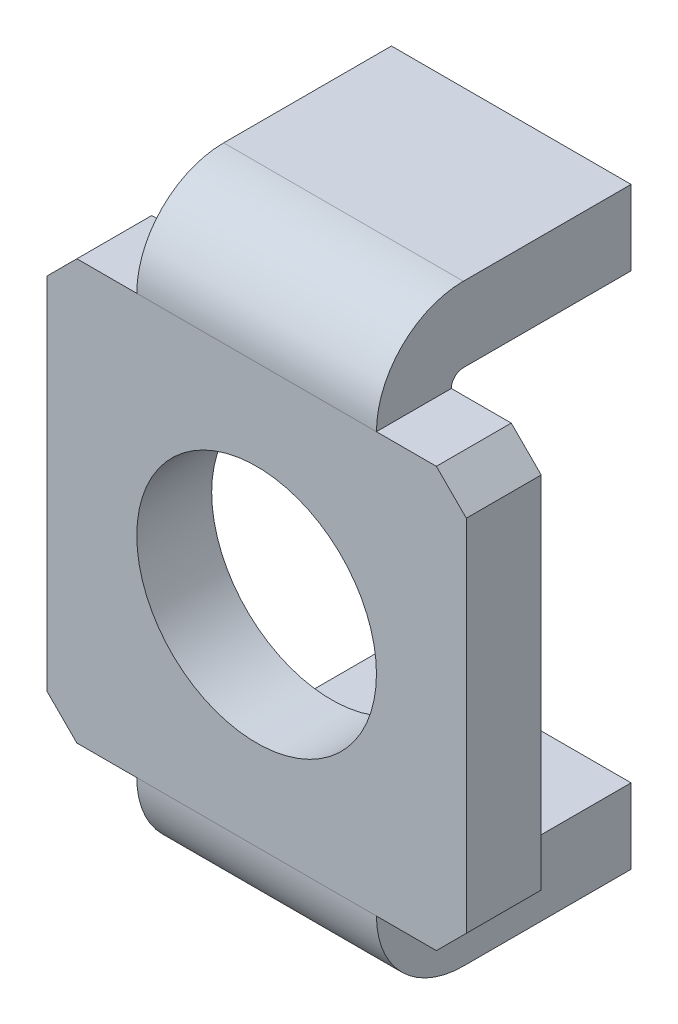
ISO-10303-21;
HEADER;
FILE_DESCRIPTION(('STEP AP214'),'2;1');
FILE_NAME('part.step','',(''),(''),'','','');
FILE_SCHEMA(('AUTOMOTIVE_DESIGN { 1 0 10303 214 1 1 1 1 }'));
ENDSEC;
DATA;
#1=APPLICATION_CONTEXT('core data for automotive mechanical design processes');
#2=APPLICATION_PROTOCOL_DEFINITION('international standard','automotive_design',2000,#1);
#3=PRODUCT_CONTEXT('',#1,'mechanical');
#4=PRODUCT('Part','Part','',(#3));
#5=PRODUCT_RELATED_PRODUCT_CATEGORY('part','',(#4));
#6=PRODUCT_DEFINITION_FORMATION('','',#4);
#7=PRODUCT_DEFINITION_CONTEXT('part definition',#1,'design');
#8=PRODUCT_DEFINITION('design','',#6,#7);
#9=PRODUCT_DEFINITION_SHAPE('','',#8);
#10=(LENGTH_UNIT() NAMED_UNIT(*) SI_UNIT(.MILLI.,.METRE.));
#11=(NAMED_UNIT(*) PLANE_ANGLE_UNIT() SI_UNIT($,.RADIAN.));
#12=(NAMED_UNIT(*) SI_UNIT($,.STERADIAN.) SOLID_ANGLE_UNIT());
#13=UNCERTAINTY_MEASURE_WITH_UNIT(LENGTH_MEASURE(1.E-05),#10,'distance_accuracy_value','');
#14=(GEOMETRIC_REPRESENTATION_CONTEXT(3) GLOBAL_UNCERTAINTY_ASSIGNED_CONTEXT((#13)) GLOBAL_UNIT_ASSIGNED_CONTEXT((#10,
#11,#12)) REPRESENTATION_CONTEXT('',''));
#15=CARTESIAN_POINT('',(0.,0.,0.));
#16=DIRECTION('',(0.,0.,1.));
#17=DIRECTION('',(1.,0.,0.));
#18=AXIS2_PLACEMENT_3D('',#15,#16,#17);
#19=CARTESIAN_POINT('',(0.,-4.95,0.));
#20=DIRECTION('',(0.,1.,0.));
#21=DIRECTION('',(0.,0.,1.));
#22=AXIS2_PLACEMENT_3D('',#19,#20,#21);
#23=PLANE('',#22);
#24=DIRECTION('',(0.,0.,1.));
#25=VECTOR('',#24,1.);
#26=CARTESIAN_POINT('',(-2.,-4.95,-4.25));
#27=LINE('',#26,#25);
#28=CARTESIAN_POINT('',(-2.,-4.95,-4.25));
#29=VERTEX_POINT('',#28);
#30=CARTESIAN_POINT('',(-2.,-4.95,-1.45));
#31=VERTEX_POINT('',#30);
#32=EDGE_CURVE('E189',#29,#31,#27,.T.);
#33=ORIENTED_EDGE('',*,*,#32,.F.);
#34=DIRECTION('',(1.,0.,0.));
#35=VECTOR('',#34,1.);
#36=CARTESIAN_POINT('',(-2.,-4.95,-4.25));
#37=LINE('',#36,#35);
#38=CARTESIAN_POINT('',(2.,-4.95,-4.25));
#39=VERTEX_POINT('',#38);
#40=EDGE_CURVE('E199',#39,#29,#37,.F.);
#41=ORIENTED_EDGE('',*,*,#40,.F.);
#42=DIRECTION('',(0.,0.,-1.));
#43=VECTOR('',#42,1.);
#44=CARTESIAN_POINT('',(2.,-4.95,-4.25));
#45=LINE('',#44,#43);
#46=CARTESIAN_POINT('',(2.,-4.95,-1.45));
#47=VERTEX_POINT('',#46);
#48=EDGE_CURVE('E192',#47,#39,#45,.T.);
#49=ORIENTED_EDGE('',*,*,#48,.F.);
#50=DIRECTION('',(-1.,0.,0.));
#51=VECTOR('',#50,1.);
#52=CARTESIAN_POINT('',(-2.,-4.95,-1.45));
#53=LINE('',#52,#51);
#54=EDGE_CURVE('E253',#31,#47,#53,.F.);
#55=ORIENTED_EDGE('',*,*,#54,.F.);
#56=EDGE_LOOP('',(#33,#41,#49,#55));
#57=FACE_BOUND('',#56,.T.);
#58=ADVANCED_FACE('F17',(#57),#23,.F.);
#59=CARTESIAN_POINT('',(0.,4.95,0.));
#60=DIRECTION('',(0.,-1.,0.));
#61=DIRECTION('',(0.,0.,-1.));
#62=AXIS2_PLACEMENT_3D('',#59,#60,#61);
#63=PLANE('',#62);
#64=DIRECTION('',(0.,0.,1.));
#65=VECTOR('',#64,1.);
#66=CARTESIAN_POINT('',(2.,4.95,-4.25));
#67=LINE('',#66,#65);
#68=CARTESIAN_POINT('',(2.,4.95,-1.45));
#69=VERTEX_POINT('',#68);
#70=CARTESIAN_POINT('',(2.,4.95,-4.25));
#71=VERTEX_POINT('',#70);
#72=EDGE_CURVE('E245',#69,#71,#67,.F.);
#73=ORIENTED_EDGE('',*,*,#72,.T.);
#74=DIRECTION('',(1.,0.,0.));
#75=VECTOR('',#74,1.);
#76=CARTESIAN_POINT('',(-2.,4.95,-4.25));
#77=LINE('',#76,#75);
#78=CARTESIAN_POINT('',(-2.,4.95,-4.25));
#79=VERTEX_POINT('',#78);
#80=EDGE_CURVE('E332',#71,#79,#77,.F.);
#81=ORIENTED_EDGE('',*,*,#80,.T.);
#82=DIRECTION('',(0.,0.,-1.));
#83=VECTOR('',#82,1.);
#84=CARTESIAN_POINT('',(-2.,4.95,-4.25));
#85=LINE('',#84,#83);
#86=CARTESIAN_POINT('',(-2.,4.95,-1.45));
#87=VERTEX_POINT('',#86);
#88=EDGE_CURVE('E337',#79,#87,#85,.F.);
#89=ORIENTED_EDGE('',*,*,#88,.T.);
#90=DIRECTION('',(1.,0.,0.));
#91=VECTOR('',#90,1.);
#92=CARTESIAN_POINT('',(2.,4.95,-1.45));
#93=LINE('',#92,#91);
#94=EDGE_CURVE('E246',#69,#87,#93,.F.);
#95=ORIENTED_EDGE('',*,*,#94,.F.);
#96=EDGE_LOOP('',(#73,#81,#89,#95));
#97=FACE_BOUND('',#96,.T.);
#98=ADVANCED_FACE('F349',(#97),#63,.F.);
#99=CARTESIAN_POINT('',(-2.,-4.95,-4.25));
#100=DIRECTION('',(-1.,0.,0.));
#101=DIRECTION('',(0.,0.,1.));
#102=AXIS2_PLACEMENT_3D('',#99,#100,#101);
#103=PLANE('',#102);
#104=DIRECTION('',(0.,0.,1.));
#105=VECTOR('',#104,1.);
#106=CARTESIAN_POINT('',(-2.,-3.7,0.));
#107=LINE('',#106,#105);
#108=CARTESIAN_POINT('',(-2.,-3.7,-4.25));
#109=VERTEX_POINT('',#108);
#110=CARTESIAN_POINT('',(-2.,-3.7,-1.45));
#111=VERTEX_POINT('',#110);
#112=EDGE_CURVE('E154',#109,#111,#107,.T.);
#113=ORIENTED_EDGE('',*,*,#112,.F.);
#114=DIRECTION('',(0.,1.,0.));
#115=VECTOR('',#114,1.);
#116=CARTESIAN_POINT('',(-2.,-4.95,-4.25));
#117=LINE('',#116,#115);
#118=EDGE_CURVE('E196',#29,#109,#117,.T.);
#119=ORIENTED_EDGE('',*,*,#118,.F.);
#120=ORIENTED_EDGE('',*,*,#32,.T.);
#121=CARTESIAN_POINT('',(-2.,-3.5,-1.45));
#122=DIRECTION('',(-1.,0.,0.));
#123=DIRECTION('',(0.,0.,1.));
#124=AXIS2_PLACEMENT_3D('',#121,#122,#123);
#125=CIRCLE('',#124,1.45);
#126=CARTESIAN_POINT('',(-2.,-3.5,0.));
#127=VERTEX_POINT('',#126);
#128=EDGE_CURVE('E198',#127,#31,#125,.F.);
#129=ORIENTED_EDGE('',*,*,#128,.F.);
#130=DIRECTION('',(0.,0.,-1.));
#131=VECTOR('',#130,1.);
#132=CARTESIAN_POINT('',(-2.,-3.5,-1.45));
#133=LINE('',#132,#131);
#134=CARTESIAN_POINT('',(-2.,-3.5,-1.25));
#135=VERTEX_POINT('',#134);
#136=EDGE_CURVE('E157',#135,#127,#133,.F.);
#137=ORIENTED_EDGE('',*,*,#136,.F.);
#138=CARTESIAN_POINT('',(-2.,-3.5,-1.45));
#139=DIRECTION('',(-1.,0.,0.));
#140=DIRECTION('',(0.,0.,1.));
#141=AXIS2_PLACEMENT_3D('',#138,#139,#140);
#142=CIRCLE('',#141,0.2);
#143=EDGE_CURVE('E20',#111,#135,#142,.T.);
#144=ORIENTED_EDGE('',*,*,#143,.F.);
#145=EDGE_LOOP('',(#113,#119,#120,#129,#137,#144));
#146=FACE_BOUND('',#145,.T.);
#147=ADVANCED_FACE('F152',(#146),#103,.T.);
#148=CARTESIAN_POINT('',(2.,-4.95,-4.25));
#149=DIRECTION('',(1.,0.,0.));
#150=DIRECTION('',(0.,0.,-1.));
#151=AXIS2_PLACEMENT_3D('',#148,#149,#150);
#152=PLANE('',#151);
#153=ORIENTED_EDGE('',*,*,#48,.T.);
#154=DIRECTION('',(0.,1.,0.));
#155=VECTOR('',#154,1.);
#156=CARTESIAN_POINT('',(2.,-4.95,-4.25));
#157=LINE('',#156,#155);
#158=CARTESIAN_POINT('',(2.,-3.7,-4.25));
#159=VERTEX_POINT('',#158);
#160=EDGE_CURVE('E276',#159,#39,#157,.F.);
#161=ORIENTED_EDGE('',*,*,#160,.F.);
#162=DIRECTION('',(0.,0.,1.));
#163=VECTOR('',#162,1.);
#164=CARTESIAN_POINT('',(2.,-3.7,0.));
#165=LINE('',#164,#163);
#166=CARTESIAN_POINT('',(2.,-3.7,-1.45));
#167=VERTEX_POINT('',#166);
#168=EDGE_CURVE('E171',#167,#159,#165,.F.);
#169=ORIENTED_EDGE('',*,*,#168,.F.);
#170=CARTESIAN_POINT('',(2.,-3.5,-1.45));
#171=DIRECTION('',(-1.,0.,0.));
#172=DIRECTION('',(0.,0.,1.));
#173=AXIS2_PLACEMENT_3D('',#170,#171,#172);
#174=CIRCLE('',#173,0.2);
#175=CARTESIAN_POINT('',(2.,-3.5,-1.25));
#176=VERTEX_POINT('',#175);
#177=EDGE_CURVE('E162',#167,#176,#174,.T.);
#178=ORIENTED_EDGE('',*,*,#177,.T.);
#179=DIRECTION('',(0.,0.,-1.));
#180=VECTOR('',#179,1.);
#181=CARTESIAN_POINT('',(2.,-3.5,-1.45));
#182=LINE('',#181,#180);
#183=CARTESIAN_POINT('',(2.,-3.5,0.));
#184=VERTEX_POINT('',#183);
#185=EDGE_CURVE('E260',#176,#184,#182,.F.);
#186=ORIENTED_EDGE('',*,*,#185,.T.);
#187=CARTESIAN_POINT('',(2.,-3.5,-1.45));
#188=DIRECTION('',(-1.,0.,0.));
#189=DIRECTION('',(0.,0.,1.));
#190=AXIS2_PLACEMENT_3D('',#187,#188,#189);
#191=CIRCLE('',#190,1.45);
#192=EDGE_CURVE('E250',#47,#184,#191,.T.);
#193=ORIENTED_EDGE('',*,*,#192,.F.);
#194=EDGE_LOOP('',(#153,#161,#169,#178,#186,#193));
#195=FACE_BOUND('',#194,.T.);
#196=ADVANCED_FACE('F288',(#195),#152,.T.);
#197=CARTESIAN_POINT('',(-2.,-4.95,-4.25));
#198=DIRECTION('',(0.,0.,-1.));
#199=DIRECTION('',(0.,1.,0.));
#200=AXIS2_PLACEMENT_3D('',#197,#198,#199);
#201=PLANE('',#200);
#202=ORIENTED_EDGE('',*,*,#40,.T.);
#203=ORIENTED_EDGE('',*,*,#118,.T.);
#204=DIRECTION('',(1.,0.,0.));
#205=VECTOR('',#204,1.);
#206=CARTESIAN_POINT('',(0.,-3.7,-4.25));
#207=LINE('',#206,#205);
#208=EDGE_CURVE('E170',#159,#109,#207,.F.);
#209=ORIENTED_EDGE('',*,*,#208,.F.);
#210=ORIENTED_EDGE('',*,*,#160,.T.);
#211=EDGE_LOOP('',(#202,#203,#209,#210));
#212=FACE_BOUND('',#211,.T.);
#213=ADVANCED_FACE('F286',(#212),#201,.T.);
#214=CARTESIAN_POINT('',(-2.,-3.5,-1.45));
#215=DIRECTION('',(-1.,0.,0.));
#216=DIRECTION('',(0.,0.,1.));
#217=AXIS2_PLACEMENT_3D('',#214,#215,#216);
#218=CYLINDRICAL_SURFACE('',#217,1.45);
#219=ORIENTED_EDGE('',*,*,#54,.T.);
#220=ORIENTED_EDGE('',*,*,#192,.T.);
#221=DIRECTION('',(-1.,0.,0.));
#222=VECTOR('',#221,1.);
#223=CARTESIAN_POINT('',(0.,-3.5,0.));
#224=LINE('',#223,#222);
#225=EDGE_CURVE('E270',#184,#127,#224,.T.);
#226=ORIENTED_EDGE('',*,*,#225,.T.);
#227=ORIENTED_EDGE('',*,*,#128,.T.);
#228=EDGE_LOOP('',(#219,#220,#226,#227));
#229=FACE_BOUND('',#228,.T.);
#230=ADVANCED_FACE('F294',(#229),#218,.T.);
#231=CARTESIAN_POINT('',(2.,3.5,-1.45));
#232=DIRECTION('',(1.,0.,0.));
#233=DIRECTION('',(0.,0.,-1.));
#234=AXIS2_PLACEMENT_3D('',#231,#232,#233);
#235=CYLINDRICAL_SURFACE('',#234,1.45);
#236=ORIENTED_EDGE('',*,*,#94,.T.);
#237=CARTESIAN_POINT('',(-2.,3.5,-1.45));
#238=DIRECTION('',(1.,0.,0.));
#239=DIRECTION('',(0.,0.,-1.));
#240=AXIS2_PLACEMENT_3D('',#237,#238,#239);
#241=CIRCLE('',#240,1.45);
#242=CARTESIAN_POINT('',(-2.,3.5,0.));
#243=VERTEX_POINT('',#242);
#244=EDGE_CURVE('E242',#87,#243,#241,.T.);
#245=ORIENTED_EDGE('',*,*,#244,.T.);
#246=DIRECTION('',(-1.,0.,0.));
#247=VECTOR('',#246,1.);
#248=CARTESIAN_POINT('',(0.,3.5,0.));
#249=LINE('',#248,#247);
#250=CARTESIAN_POINT('',(2.,3.5,0.));
#251=VERTEX_POINT('',#250);
#252=EDGE_CURVE('E343',#243,#251,#249,.F.);
#253=ORIENTED_EDGE('',*,*,#252,.T.);
#254=CARTESIAN_POINT('',(2.,3.5,-1.45));
#255=DIRECTION('',(1.,0.,0.));
#256=DIRECTION('',(0.,0.,-1.));
#257=AXIS2_PLACEMENT_3D('',#254,#255,#256);
#258=CIRCLE('',#257,1.45);
#259=EDGE_CURVE('E247',#251,#69,#258,.F.);
#260=ORIENTED_EDGE('',*,*,#259,.T.);
#261=EDGE_LOOP('',(#236,#245,#253,#260));
#262=FACE_BOUND('',#261,.T.);
#263=ADVANCED_FACE('F367',(#262),#235,.T.);
#264=CARTESIAN_POINT('',(2.,4.95,-4.25));
#265=DIRECTION('',(-1.,0.,0.));
#266=DIRECTION('',(0.,0.,1.));
#267=AXIS2_PLACEMENT_3D('',#264,#265,#266);
#268=PLANE('',#267);
#269=DIRECTION('',(0.,0.,-1.));
#270=VECTOR('',#269,1.);
#271=CARTESIAN_POINT('',(2.,3.7,0.));
#272=LINE('',#271,#270);
#273=CARTESIAN_POINT('',(2.,3.7,-4.25));
#274=VERTEX_POINT('',#273);
#275=CARTESIAN_POINT('',(2.,3.7,-1.45));
#276=VERTEX_POINT('',#275);
#277=EDGE_CURVE('E213',#274,#276,#272,.F.);
#278=ORIENTED_EDGE('',*,*,#277,.F.);
#279=DIRECTION('',(0.,-1.,0.));
#280=VECTOR('',#279,1.);
#281=CARTESIAN_POINT('',(2.,4.95,-4.25));
#282=LINE('',#281,#280);
#283=EDGE_CURVE('E334',#274,#71,#282,.F.);
#284=ORIENTED_EDGE('',*,*,#283,.T.);
#285=ORIENTED_EDGE('',*,*,#72,.F.);
#286=ORIENTED_EDGE('',*,*,#259,.F.);
#287=DIRECTION('',(0.,0.,1.));
#288=VECTOR('',#287,1.);
#289=CARTESIAN_POINT('',(2.,3.5,-1.45));
#290=LINE('',#289,#288);
#291=CARTESIAN_POINT('',(2.,3.5,-1.25));
#292=VERTEX_POINT('',#291);
#293=EDGE_CURVE('E259',#292,#251,#290,.T.);
#294=ORIENTED_EDGE('',*,*,#293,.F.);
#295=CARTESIAN_POINT('',(2.,3.5,-1.45));
#296=DIRECTION('',(1.,0.,0.));
#297=DIRECTION('',(0.,0.,-1.));
#298=AXIS2_PLACEMENT_3D('',#295,#296,#297);
#299=CIRCLE('',#298,0.2);
#300=EDGE_CURVE('E258',#276,#292,#299,.T.);
#301=ORIENTED_EDGE('',*,*,#300,.F.);
#302=EDGE_LOOP('',(#278,#284,#285,#286,#294,#301));
#303=FACE_BOUND('',#302,.T.);
#304=ADVANCED_FACE('F355',(#303),#268,.F.);
#305=CARTESIAN_POINT('',(-2.,4.95,-4.25));
#306=DIRECTION('',(1.,0.,0.));
#307=DIRECTION('',(0.,0.,-1.));
#308=AXIS2_PLACEMENT_3D('',#305,#306,#307);
#309=PLANE('',#308);
#310=ORIENTED_EDGE('',*,*,#88,.F.);
#311=DIRECTION('',(0.,-1.,0.));
#312=VECTOR('',#311,1.);
#313=CARTESIAN_POINT('',(-2.,4.95,-4.25));
#314=LINE('',#313,#312);
#315=CARTESIAN_POINT('',(-2.,3.7,-4.25));
#316=VERTEX_POINT('',#315);
#317=EDGE_CURVE('E172',#79,#316,#314,.T.);
#318=ORIENTED_EDGE('',*,*,#317,.T.);
#319=DIRECTION('',(0.,0.,-1.));
#320=VECTOR('',#319,1.);
#321=CARTESIAN_POINT('',(-2.,3.7,0.));
#322=LINE('',#321,#320);
#323=CARTESIAN_POINT('',(-2.,3.7,-1.45));
#324=VERTEX_POINT('',#323);
#325=EDGE_CURVE('E209',#324,#316,#322,.T.);
#326=ORIENTED_EDGE('',*,*,#325,.F.);
#327=CARTESIAN_POINT('',(-2.,3.5,-1.45));
#328=DIRECTION('',(1.,0.,0.));
#329=DIRECTION('',(0.,0.,-1.));
#330=AXIS2_PLACEMENT_3D('',#327,#328,#329);
#331=CIRCLE('',#330,0.2);
#332=CARTESIAN_POINT('',(-2.,3.5,-1.25));
#333=VERTEX_POINT('',#332);
#334=EDGE_CURVE('E255',#324,#333,#331,.T.);
#335=ORIENTED_EDGE('',*,*,#334,.T.);
#336=DIRECTION('',(0.,0.,1.));
#337=VECTOR('',#336,1.);
#338=CARTESIAN_POINT('',(-2.,3.5,-1.45));
#339=LINE('',#338,#337);
#340=EDGE_CURVE('E193',#333,#243,#339,.T.);
#341=ORIENTED_EDGE('',*,*,#340,.T.);
#342=ORIENTED_EDGE('',*,*,#244,.F.);
#343=EDGE_LOOP('',(#310,#318,#326,#335,#341,#342));
#344=FACE_BOUND('',#343,.T.);
#345=ADVANCED_FACE('F363',(#344),#309,.F.);
#346=CARTESIAN_POINT('',(-2.,4.95,-4.25));
#347=DIRECTION('',(0.,0.,1.));
#348=DIRECTION('',(0.,-1.,0.));
#349=AXIS2_PLACEMENT_3D('',#346,#347,#348);
#350=PLANE('',#349);
#351=ORIENTED_EDGE('',*,*,#317,.F.);
#352=ORIENTED_EDGE('',*,*,#80,.F.);
#353=ORIENTED_EDGE('',*,*,#283,.F.);
#354=DIRECTION('',(1.,0.,0.));
#355=VECTOR('',#354,1.);
#356=CARTESIAN_POINT('',(0.,3.7,-4.25));
#357=LINE('',#356,#355);
#358=EDGE_CURVE('E212',#316,#274,#357,.T.);
#359=ORIENTED_EDGE('',*,*,#358,.F.);
#360=EDGE_LOOP('',(#351,#352,#353,#359));
#361=FACE_BOUND('',#360,.T.);
#362=ADVANCED_FACE('F360',(#361),#350,.F.);
#363=CARTESIAN_POINT('',(0.,-3.7,0.));
#364=DIRECTION('',(0.,1.,0.));
#365=DIRECTION('',(0.,0.,1.));
#366=AXIS2_PLACEMENT_3D('',#363,#364,#365);
#367=PLANE('',#366);
#368=ORIENTED_EDGE('',*,*,#168,.T.);
#369=ORIENTED_EDGE('',*,*,#208,.T.);
#370=ORIENTED_EDGE('',*,*,#112,.T.);
#371=DIRECTION('',(-1.,0.,0.));
#372=VECTOR('',#371,1.);
#373=CARTESIAN_POINT('',(-2.,-3.7,-1.45));
#374=LINE('',#373,#372);
#375=EDGE_CURVE('E168',#111,#167,#374,.F.);
#376=ORIENTED_EDGE('',*,*,#375,.T.);
#377=EDGE_LOOP('',(#368,#369,#370,#376));
#378=FACE_BOUND('',#377,.T.);
#379=ADVANCED_FACE('F167',(#378),#367,.T.);
#380=CARTESIAN_POINT('',(0.,0.,0.));
#381=DIRECTION('',(0.,0.,-1.));
#382=DIRECTION('',(-1.,0.,0.));
#383=AXIS2_PLACEMENT_3D('',#380,#381,#382);
#384=PLANE('',#383);
#385=DIRECTION('',(-0.707106781186547,-0.707106781186549,0.));
#386=VECTOR('',#385,1.);
#387=CARTESIAN_POINT('',(3.,-3.5,0.));
#388=LINE('',#387,#386);
#389=CARTESIAN_POINT('',(3.,-3.5,0.));
#390=VERTEX_POINT('',#389);
#391=CARTESIAN_POINT('',(3.5,-3.,0.));
#392=VERTEX_POINT('',#391);
#393=EDGE_CURVE('E321',#390,#392,#388,.F.);
#394=ORIENTED_EDGE('',*,*,#393,.T.);
#395=DIRECTION('',(0.,1.,0.));
#396=VECTOR('',#395,1.);
#397=CARTESIAN_POINT('',(3.5,3.5,0.));
#398=LINE('',#397,#396);
#399=CARTESIAN_POINT('',(3.5,3.,0.));
#400=VERTEX_POINT('',#399);
#401=EDGE_CURVE('E241',#400,#392,#398,.F.);
#402=ORIENTED_EDGE('',*,*,#401,.F.);
#403=DIRECTION('',(0.707106781186549,-0.707106781186547,0.));
#404=VECTOR('',#403,1.);
#405=CARTESIAN_POINT('',(3.,3.5,0.));
#406=LINE('',#405,#404);
#407=CARTESIAN_POINT('',(3.,3.5,0.));
#408=VERTEX_POINT('',#407);
#409=EDGE_CURVE('E223',#408,#400,#406,.T.);
#410=ORIENTED_EDGE('',*,*,#409,.F.);
#411=DIRECTION('',(-1.,0.,0.));
#412=VECTOR('',#411,1.);
#413=CARTESIAN_POINT('',(0.,3.5,0.));
#414=LINE('',#413,#412);
#415=EDGE_CURVE('E267',#251,#408,#414,.F.);
#416=ORIENTED_EDGE('',*,*,#415,.F.);
#417=ORIENTED_EDGE('',*,*,#252,.F.);
#418=DIRECTION('',(-1.,0.,0.));
#419=VECTOR('',#418,1.);
#420=CARTESIAN_POINT('',(0.,3.5,0.));
#421=LINE('',#420,#419);
#422=CARTESIAN_POINT('',(-3.,3.5,0.));
#423=VERTEX_POINT('',#422);
#424=EDGE_CURVE('E329',#423,#243,#421,.F.);
#425=ORIENTED_EDGE('',*,*,#424,.F.);
#426=DIRECTION('',(0.707106781186547,0.707106781186548,0.));
#427=VECTOR('',#426,1.);
#428=CARTESIAN_POINT('',(-3.5,3.,0.));
#429=LINE('',#428,#427);
#430=CARTESIAN_POINT('',(-3.5,3.,0.));
#431=VERTEX_POINT('',#430);
#432=EDGE_CURVE('E272',#431,#423,#429,.T.);
#433=ORIENTED_EDGE('',*,*,#432,.F.);
#434=DIRECTION('',(0.,-1.,0.));
#435=VECTOR('',#434,1.);
#436=CARTESIAN_POINT('',(-3.5,3.5,0.));
#437=LINE('',#436,#435);
#438=CARTESIAN_POINT('',(-3.5,-3.,0.));
#439=VERTEX_POINT('',#438);
#440=EDGE_CURVE('E312',#439,#431,#437,.F.);
#441=ORIENTED_EDGE('',*,*,#440,.F.);
#442=DIRECTION('',(-0.707106781186549,0.707106781186546,0.));
#443=VECTOR('',#442,1.);
#444=CARTESIAN_POINT('',(-3.5,-3.,0.));
#445=LINE('',#444,#443);
#446=CARTESIAN_POINT('',(-3.,-3.5,0.));
#447=VERTEX_POINT('',#446);
#448=EDGE_CURVE('E181',#439,#447,#445,.F.);
#449=ORIENTED_EDGE('',*,*,#448,.T.);
#450=DIRECTION('',(1.,0.,0.));
#451=VECTOR('',#450,1.);
#452=CARTESIAN_POINT('',(3.5,-3.5,0.));
#453=LINE('',#452,#451);
#454=EDGE_CURVE('E177',#127,#447,#453,.F.);
#455=ORIENTED_EDGE('',*,*,#454,.F.);
#456=ORIENTED_EDGE('',*,*,#225,.F.);
#457=DIRECTION('',(1.,0.,0.));
#458=VECTOR('',#457,1.);
#459=CARTESIAN_POINT('',(3.5,-3.5,0.));
#460=LINE('',#459,#458);
#461=EDGE_CURVE('E178',#390,#184,#460,.F.);
#462=ORIENTED_EDGE('',*,*,#461,.F.);
#463=EDGE_LOOP('',(#394,#402,#410,#416,#417,#425,#433,#441,#449,#455,#456,#462));
#464=FACE_BOUND('',#463,.T.);
#465=CARTESIAN_POINT('',(0.,0.,0.));
#466=DIRECTION('',(0.,0.,1.));
#467=DIRECTION('',(1.,0.,0.));
#468=AXIS2_PLACEMENT_3D('',#465,#466,#467);
#469=CIRCLE('',#468,2.);
#470=CARTESIAN_POINT('',(2.,0.,0.));
#471=VERTEX_POINT('',#470);
#472=EDGE_CURVE('E238',#471,#471,#469,.F.);
#473=ORIENTED_EDGE('',*,*,#472,.T.);
#474=EDGE_LOOP('',(#473));
#475=FACE_BOUND('',#474,.T.);
#476=ADVANCED_FACE('F297',(#464,#475),#384,.F.);
#477=CARTESIAN_POINT('',(0.,3.7,0.));
#478=DIRECTION('',(0.,-1.,0.));
#479=DIRECTION('',(0.,0.,-1.));
#480=AXIS2_PLACEMENT_3D('',#477,#478,#479);
#481=PLANE('',#480);
#482=ORIENTED_EDGE('',*,*,#325,.T.);
#483=ORIENTED_EDGE('',*,*,#358,.T.);
#484=ORIENTED_EDGE('',*,*,#277,.T.);
#485=DIRECTION('',(1.,0.,0.));
#486=VECTOR('',#485,1.);
#487=CARTESIAN_POINT('',(2.,3.7,-1.45));
#488=LINE('',#487,#486);
#489=EDGE_CURVE('E214',#276,#324,#488,.F.);
#490=ORIENTED_EDGE('',*,*,#489,.T.);
#491=EDGE_LOOP('',(#482,#483,#484,#490));
#492=FACE_BOUND('',#491,.T.);
#493=ADVANCED_FACE('F381',(#492),#481,.T.);
#494=CARTESIAN_POINT('',(0.,0.,-1.25));
#495=DIRECTION('',(0.,0.,1.));
#496=DIRECTION('',(1.,0.,0.));
#497=AXIS2_PLACEMENT_3D('',#494,#495,#496);
#498=CYLINDRICAL_SURFACE('',#497,2.);
#499=ORIENTED_EDGE('',*,*,#472,.F.);
#500=EDGE_LOOP('',(#499));
#501=FACE_BOUND('',#500,.T.);
#502=CARTESIAN_POINT('',(0.,0.,-1.25));
#503=DIRECTION('',(0.,0.,1.));
#504=DIRECTION('',(1.,0.,0.));
#505=AXIS2_PLACEMENT_3D('',#502,#503,#504);
#506=CIRCLE('',#505,2.);
#507=CARTESIAN_POINT('',(2.,0.,-1.25));
#508=VERTEX_POINT('',#507);
#509=EDGE_CURVE('E234',#508,#508,#506,.T.);
#510=ORIENTED_EDGE('',*,*,#509,.F.);
#511=EDGE_LOOP('',(#510));
#512=FACE_BOUND('',#511,.T.);
#513=ADVANCED_FACE('F383',(#501,#512),#498,.F.);
#514=CARTESIAN_POINT('',(3.5,3.5,-1.25));
#515=DIRECTION('',(1.,0.,0.));
#516=DIRECTION('',(0.,1.,0.));
#517=AXIS2_PLACEMENT_3D('',#514,#515,#516);
#518=PLANE('',#517);
#519=DIRECTION('',(0.,1.,0.));
#520=VECTOR('',#519,1.);
#521=CARTESIAN_POINT('',(3.5,0.,-1.25));
#522=LINE('',#521,#520);
#523=CARTESIAN_POINT('',(3.5,3.,-1.25));
#524=VERTEX_POINT('',#523);
#525=CARTESIAN_POINT('',(3.5,-3.,-1.25));
#526=VERTEX_POINT('',#525);
#527=EDGE_CURVE('E237',#524,#526,#522,.F.);
#528=ORIENTED_EDGE('',*,*,#527,.F.);
#529=DIRECTION('',(0.,0.,1.));
#530=VECTOR('',#529,1.);
#531=CARTESIAN_POINT('',(3.5,3.,-1.25));
#532=LINE('',#531,#530);
#533=EDGE_CURVE('E217',#524,#400,#532,.T.);
#534=ORIENTED_EDGE('',*,*,#533,.T.);
#535=ORIENTED_EDGE('',*,*,#401,.T.);
#536=DIRECTION('',(0.,0.,1.));
#537=VECTOR('',#536,1.);
#538=CARTESIAN_POINT('',(3.5,-3.,-1.25));
#539=LINE('',#538,#537);
#540=EDGE_CURVE('E319',#392,#526,#539,.F.);
#541=ORIENTED_EDGE('',*,*,#540,.T.);
#542=EDGE_LOOP('',(#528,#534,#535,#541));
#543=FACE_BOUND('',#542,.T.);
#544=ADVANCED_FACE('F391',(#543),#518,.T.);
#545=CARTESIAN_POINT('',(3.,-3.5,-1.25));
#546=DIRECTION('',(-0.707106781186549,0.707106781186547,0.));
#547=DIRECTION('',(-0.707106781186547,-0.707106781186549,0.));
#548=AXIS2_PLACEMENT_3D('',#545,#546,#547);
#549=PLANE('',#548);
#550=ORIENTED_EDGE('',*,*,#540,.F.);
#551=ORIENTED_EDGE('',*,*,#393,.F.);
#552=DIRECTION('',(0.,0.,1.));
#553=VECTOR('',#552,1.);
#554=CARTESIAN_POINT('',(3.,-3.5,-1.25));
#555=LINE('',#554,#553);
#556=CARTESIAN_POINT('',(3.,-3.5,-1.25));
#557=VERTEX_POINT('',#556);
#558=EDGE_CURVE('E184',#557,#390,#555,.T.);
#559=ORIENTED_EDGE('',*,*,#558,.F.);
#560=DIRECTION('',(-0.707106781186547,-0.707106781186548,0.));
#561=VECTOR('',#560,1.);
#562=CARTESIAN_POINT('',(3.5,-3.,-1.25));
#563=LINE('',#562,#561);
#564=EDGE_CURVE('E230',#526,#557,#563,.T.);
#565=ORIENTED_EDGE('',*,*,#564,.F.);
#566=EDGE_LOOP('',(#550,#551,#559,#565));
#567=FACE_BOUND('',#566,.T.);
#568=ADVANCED_FACE('F430',(#567),#549,.F.);
#569=CARTESIAN_POINT('',(3.5,-3.5,-1.25));
#570=DIRECTION('',(0.,-1.,0.));
#571=DIRECTION('',(1.,0.,0.));
#572=AXIS2_PLACEMENT_3D('',#569,#570,#571);
#573=PLANE('',#572);
#574=ORIENTED_EDGE('',*,*,#461,.T.);
#575=ORIENTED_EDGE('',*,*,#185,.F.);
#576=DIRECTION('',(-1.,0.,0.));
#577=VECTOR('',#576,1.);
#578=CARTESIAN_POINT('',(0.,-3.5,-1.25));
#579=LINE('',#578,#577);
#580=EDGE_CURVE('E227',#557,#176,#579,.T.);
#581=ORIENTED_EDGE('',*,*,#580,.F.);
#582=ORIENTED_EDGE('',*,*,#558,.T.);
#583=EDGE_LOOP('',(#574,#575,#581,#582));
#584=FACE_BOUND('',#583,.T.);
#585=ADVANCED_FACE('F427',(#584),#573,.T.);
#586=CARTESIAN_POINT('',(-2.,-3.5,-1.45));
#587=DIRECTION('',(-1.,0.,0.));
#588=DIRECTION('',(0.,0.,1.));
#589=AXIS2_PLACEMENT_3D('',#586,#587,#588);
#590=CYLINDRICAL_SURFACE('',#589,0.2);
#591=ORIENTED_EDGE('',*,*,#177,.F.);
#592=ORIENTED_EDGE('',*,*,#375,.F.);
#593=ORIENTED_EDGE('',*,*,#143,.T.);
#594=DIRECTION('',(-1.,0.,0.));
#595=VECTOR('',#594,1.);
#596=CARTESIAN_POINT('',(0.,-3.5,-1.25));
#597=LINE('',#596,#595);
#598=EDGE_CURVE('E224',#176,#135,#597,.T.);
#599=ORIENTED_EDGE('',*,*,#598,.F.);
#600=EDGE_LOOP('',(#591,#592,#593,#599));
#601=FACE_BOUND('',#600,.T.);
#602=ADVANCED_FACE('F174',(#601),#590,.F.);
#603=CARTESIAN_POINT('',(3.5,-3.5,-1.25));
#604=DIRECTION('',(0.,-1.,0.));
#605=DIRECTION('',(1.,0.,0.));
#606=AXIS2_PLACEMENT_3D('',#603,#604,#605);
#607=PLANE('',#606);
#608=DIRECTION('',(-1.,0.,0.));
#609=VECTOR('',#608,1.);
#610=CARTESIAN_POINT('',(0.,-3.5,-1.25));
#611=LINE('',#610,#609);
#612=CARTESIAN_POINT('',(-3.,-3.5,-1.25));
#613=VERTEX_POINT('',#612);
#614=EDGE_CURVE('E226',#135,#613,#611,.T.);
#615=ORIENTED_EDGE('',*,*,#614,.F.);
#616=ORIENTED_EDGE('',*,*,#136,.T.);
#617=ORIENTED_EDGE('',*,*,#454,.T.);
#618=DIRECTION('',(0.,0.,1.));
#619=VECTOR('',#618,1.);
#620=CARTESIAN_POINT('',(-3.,-3.5,-1.25));
#621=LINE('',#620,#619);
#622=EDGE_CURVE('E304',#447,#613,#621,.F.);
#623=ORIENTED_EDGE('',*,*,#622,.T.);
#624=EDGE_LOOP('',(#615,#616,#617,#623));
#625=FACE_BOUND('',#624,.T.);
#626=ADVANCED_FACE('F303',(#625),#607,.T.);
#627=CARTESIAN_POINT('',(-3.5,-3.,-1.25));
#628=DIRECTION('',(0.707106781186546,0.707106781186549,0.));
#629=DIRECTION('',(-0.707106781186549,0.707106781186546,0.));
#630=AXIS2_PLACEMENT_3D('',#627,#628,#629);
#631=PLANE('',#630);
#632=ORIENTED_EDGE('',*,*,#622,.F.);
#633=ORIENTED_EDGE('',*,*,#448,.F.);
#634=DIRECTION('',(0.,0.,1.));
#635=VECTOR('',#634,1.);
#636=CARTESIAN_POINT('',(-3.5,-3.,-1.25));
#637=LINE('',#636,#635);
#638=CARTESIAN_POINT('',(-3.5,-3.,-1.25));
#639=VERTEX_POINT('',#638);
#640=EDGE_CURVE('E309',#639,#439,#637,.T.);
#641=ORIENTED_EDGE('',*,*,#640,.F.);
#642=DIRECTION('',(-0.707106781186549,0.707106781186546,0.));
#643=VECTOR('',#642,1.);
#644=CARTESIAN_POINT('',(-3.,-3.5,-1.25));
#645=LINE('',#644,#643);
#646=EDGE_CURVE('E233',#613,#639,#645,.T.);
#647=ORIENTED_EDGE('',*,*,#646,.F.);
#648=EDGE_LOOP('',(#632,#633,#641,#647));
#649=FACE_BOUND('',#648,.T.);
#650=ADVANCED_FACE('F307',(#649),#631,.F.);
#651=CARTESIAN_POINT('',(-3.5,3.5,-1.25));
#652=DIRECTION('',(-1.,0.,0.));
#653=DIRECTION('',(0.,-1.,0.));
#654=AXIS2_PLACEMENT_3D('',#651,#652,#653);
#655=PLANE('',#654);
#656=ORIENTED_EDGE('',*,*,#440,.T.);
#657=DIRECTION('',(0.,0.,1.));
#658=VECTOR('',#657,1.);
#659=CARTESIAN_POINT('',(-3.5,3.,-1.25));
#660=LINE('',#659,#658);
#661=CARTESIAN_POINT('',(-3.5,3.,-1.25));
#662=VERTEX_POINT('',#661);
#663=EDGE_CURVE('E453',#431,#662,#660,.F.);
#664=ORIENTED_EDGE('',*,*,#663,.T.);
#665=DIRECTION('',(0.,1.,0.));
#666=VECTOR('',#665,1.);
#667=CARTESIAN_POINT('',(-3.5,0.,-1.25));
#668=LINE('',#667,#666);
#669=EDGE_CURVE('E459',#639,#662,#668,.T.);
#670=ORIENTED_EDGE('',*,*,#669,.F.);
#671=ORIENTED_EDGE('',*,*,#640,.T.);
#672=EDGE_LOOP('',(#656,#664,#670,#671));
#673=FACE_BOUND('',#672,.T.);
#674=ADVANCED_FACE('F416',(#673),#655,.T.);
#675=CARTESIAN_POINT('',(-3.,3.5,-1.25));
#676=DIRECTION('',(0.707106781186549,-0.707106781186546,0.));
#677=DIRECTION('',(0.707106781186546,0.707106781186549,0.));
#678=AXIS2_PLACEMENT_3D('',#675,#676,#677);
#679=PLANE('',#678);
#680=ORIENTED_EDGE('',*,*,#663,.F.);
#681=ORIENTED_EDGE('',*,*,#432,.T.);
#682=DIRECTION('',(0.,0.,1.));
#683=VECTOR('',#682,1.);
#684=CARTESIAN_POINT('',(-3.,3.5,-1.25));
#685=LINE('',#684,#683);
#686=CARTESIAN_POINT('',(-3.,3.5,-1.25));
#687=VERTEX_POINT('',#686);
#688=EDGE_CURVE('E218',#687,#423,#685,.T.);
#689=ORIENTED_EDGE('',*,*,#688,.F.);
#690=DIRECTION('',(0.707106781186547,0.707106781186548,0.));
#691=VECTOR('',#690,1.);
#692=CARTESIAN_POINT('',(-3.5,3.,-1.25));
#693=LINE('',#692,#691);
#694=EDGE_CURVE('E208',#662,#687,#693,.T.);
#695=ORIENTED_EDGE('',*,*,#694,.F.);
#696=EDGE_LOOP('',(#680,#681,#689,#695));
#697=FACE_BOUND('',#696,.T.);
#698=ADVANCED_FACE('F412',(#697),#679,.F.);
#699=CARTESIAN_POINT('',(3.5,3.5,-1.25));
#700=DIRECTION('',(0.,1.,0.));
#701=DIRECTION('',(0.,0.,1.));
#702=AXIS2_PLACEMENT_3D('',#699,#700,#701);
#703=PLANE('',#702);
#704=ORIENTED_EDGE('',*,*,#424,.T.);
#705=ORIENTED_EDGE('',*,*,#340,.F.);
#706=DIRECTION('',(-1.,0.,0.));
#707=VECTOR('',#706,1.);
#708=CARTESIAN_POINT('',(0.,3.5,-1.25));
#709=LINE('',#708,#707);
#710=EDGE_CURVE('E205',#687,#333,#709,.F.);
#711=ORIENTED_EDGE('',*,*,#710,.F.);
#712=ORIENTED_EDGE('',*,*,#688,.T.);
#713=EDGE_LOOP('',(#704,#705,#711,#712));
#714=FACE_BOUND('',#713,.T.);
#715=ADVANCED_FACE('F409',(#714),#703,.T.);
#716=CARTESIAN_POINT('',(2.,3.5,-1.45));
#717=DIRECTION('',(1.,0.,0.));
#718=DIRECTION('',(0.,0.,-1.));
#719=AXIS2_PLACEMENT_3D('',#716,#717,#718);
#720=CYLINDRICAL_SURFACE('',#719,0.2);
#721=ORIENTED_EDGE('',*,*,#334,.F.);
#722=ORIENTED_EDGE('',*,*,#489,.F.);
#723=ORIENTED_EDGE('',*,*,#300,.T.);
#724=DIRECTION('',(-1.,0.,0.));
#725=VECTOR('',#724,1.);
#726=CARTESIAN_POINT('',(0.,3.5,-1.25));
#727=LINE('',#726,#725);
#728=EDGE_CURVE('E202',#333,#292,#727,.F.);
#729=ORIENTED_EDGE('',*,*,#728,.F.);
#730=EDGE_LOOP('',(#721,#722,#723,#729));
#731=FACE_BOUND('',#730,.T.);
#732=ADVANCED_FACE('F379',(#731),#720,.F.);
#733=CARTESIAN_POINT('',(3.5,3.5,-1.25));
#734=DIRECTION('',(0.,1.,0.));
#735=DIRECTION('',(0.,0.,1.));
#736=AXIS2_PLACEMENT_3D('',#733,#734,#735);
#737=PLANE('',#736);
#738=DIRECTION('',(-1.,0.,0.));
#739=VECTOR('',#738,1.);
#740=CARTESIAN_POINT('',(0.,3.5,-1.25));
#741=LINE('',#740,#739);
#742=CARTESIAN_POINT('',(3.,3.5,-1.25));
#743=VERTEX_POINT('',#742);
#744=EDGE_CURVE('E26',#292,#743,#741,.F.);
#745=ORIENTED_EDGE('',*,*,#744,.F.);
#746=ORIENTED_EDGE('',*,*,#293,.T.);
#747=ORIENTED_EDGE('',*,*,#415,.T.);
#748=DIRECTION('',(0.,0.,1.));
#749=VECTOR('',#748,1.);
#750=CARTESIAN_POINT('',(3.,3.5,-1.25));
#751=LINE('',#750,#749);
#752=EDGE_CURVE('E35',#408,#743,#751,.F.);
#753=ORIENTED_EDGE('',*,*,#752,.T.);
#754=EDGE_LOOP('',(#745,#746,#747,#753));
#755=FACE_BOUND('',#754,.T.);
#756=ADVANCED_FACE('F370',(#755),#737,.T.);
#757=CARTESIAN_POINT('',(3.5,3.,-1.25));
#758=DIRECTION('',(-0.707106781186546,-0.707106781186549,0.));
#759=DIRECTION('',(0.707106781186549,-0.707106781186546,0.));
#760=AXIS2_PLACEMENT_3D('',#757,#758,#759);
#761=PLANE('',#760);
#762=ORIENTED_EDGE('',*,*,#752,.F.);
#763=ORIENTED_EDGE('',*,*,#409,.T.);
#764=ORIENTED_EDGE('',*,*,#533,.F.);
#765=DIRECTION('',(0.707106781186549,-0.707106781186546,0.));
#766=VECTOR('',#765,1.);
#767=CARTESIAN_POINT('',(3.,3.5,-1.25));
#768=LINE('',#767,#766);
#769=EDGE_CURVE('E11',#743,#524,#768,.T.);
#770=ORIENTED_EDGE('',*,*,#769,.F.);
#771=EDGE_LOOP('',(#762,#763,#764,#770));
#772=FACE_BOUND('',#771,.T.);
#773=ADVANCED_FACE('F396',(#772),#761,.F.);
#774=CARTESIAN_POINT('',(0.,0.,-1.25));
#775=DIRECTION('',(0.,0.,-1.));
#776=DIRECTION('',(-1.,0.,0.));
#777=AXIS2_PLACEMENT_3D('',#774,#775,#776);
#778=PLANE('',#777);
#779=ORIENTED_EDGE('',*,*,#744,.T.);
#780=ORIENTED_EDGE('',*,*,#769,.T.);
#781=ORIENTED_EDGE('',*,*,#527,.T.);
#782=ORIENTED_EDGE('',*,*,#564,.T.);
#783=ORIENTED_EDGE('',*,*,#580,.T.);
#784=ORIENTED_EDGE('',*,*,#598,.T.);
#785=ORIENTED_EDGE('',*,*,#614,.T.);
#786=ORIENTED_EDGE('',*,*,#646,.T.);
#787=ORIENTED_EDGE('',*,*,#669,.T.);
#788=ORIENTED_EDGE('',*,*,#694,.T.);
#789=ORIENTED_EDGE('',*,*,#710,.T.);
#790=ORIENTED_EDGE('',*,*,#728,.T.);
#791=EDGE_LOOP('',(#779,#780,#781,#782,#783,#784,#785,#786,#787,#788,#789,#790));
#792=FACE_BOUND('',#791,.T.);
#793=ORIENTED_EDGE('',*,*,#509,.T.);
#794=EDGE_LOOP('',(#793));
#795=FACE_BOUND('',#794,.T.);
#796=ADVANCED_FACE('F372',(#792,#795),#778,.T.);
#797=CLOSED_SHELL('',(#58,#98,#147,#196,#213,#230,#263,#304,#345,#362,#379,#476,#493,#513,#544,
#568,#585,#602,#626,#650,#674,#698,#715,#732,#756,#773,#796));
#798=MANIFOLD_SOLID_BREP('B1',#797);
#799=ADVANCED_BREP_SHAPE_REPRESENTATION('',(#18,#798),#14);
#800=SHAPE_DEFINITION_REPRESENTATION(#9,#799);
ENDSEC;
END-ISO-10303-21;
